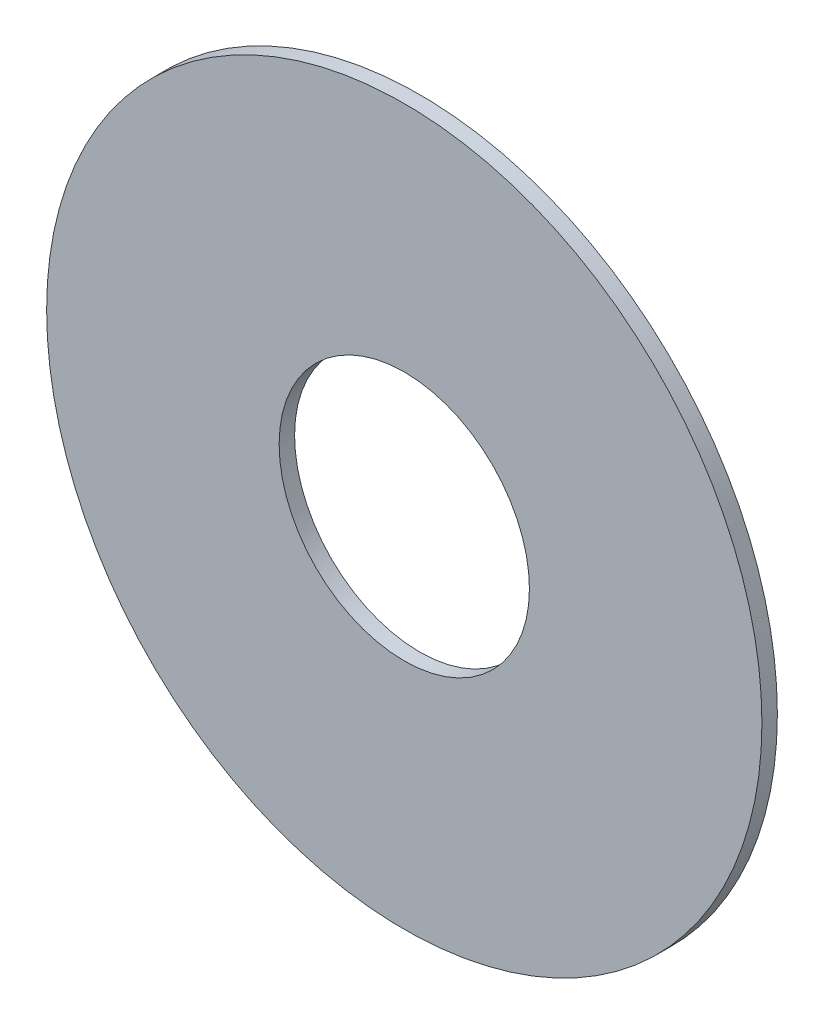
ISO-10303-21;
HEADER;
FILE_DESCRIPTION(('STEP AP214'),'2;1');
FILE_NAME('part.step','',(''),(''),'','','');
FILE_SCHEMA(('AUTOMOTIVE_DESIGN { 1 0 10303 214 1 1 1 1 }'));
ENDSEC;
DATA;
#1=APPLICATION_CONTEXT('core data for automotive mechanical design processes');
#2=APPLICATION_PROTOCOL_DEFINITION('international standard','automotive_design',2000,#1);
#3=PRODUCT_CONTEXT('',#1,'mechanical');
#4=PRODUCT('Part','Part','',(#3));
#5=PRODUCT_RELATED_PRODUCT_CATEGORY('part','',(#4));
#6=PRODUCT_DEFINITION_FORMATION('','',#4);
#7=PRODUCT_DEFINITION_CONTEXT('part definition',#1,'design');
#8=PRODUCT_DEFINITION('design','',#6,#7);
#9=PRODUCT_DEFINITION_SHAPE('','',#8);
#10=(LENGTH_UNIT() NAMED_UNIT(*) SI_UNIT(.MILLI.,.METRE.));
#11=(NAMED_UNIT(*) PLANE_ANGLE_UNIT() SI_UNIT($,.RADIAN.));
#12=(NAMED_UNIT(*) SI_UNIT($,.STERADIAN.) SOLID_ANGLE_UNIT());
#13=UNCERTAINTY_MEASURE_WITH_UNIT(LENGTH_MEASURE(1.E-05),#10,'distance_accuracy_value','');
#14=(GEOMETRIC_REPRESENTATION_CONTEXT(3) GLOBAL_UNCERTAINTY_ASSIGNED_CONTEXT((#13)) GLOBAL_UNIT_ASSIGNED_CONTEXT((#10,
#11,#12)) REPRESENTATION_CONTEXT('',''));
#15=CARTESIAN_POINT('',(0.,0.,0.));
#16=DIRECTION('',(0.,0.,1.));
#17=DIRECTION('',(1.,0.,0.));
#18=AXIS2_PLACEMENT_3D('',#15,#16,#17);
#19=CARTESIAN_POINT('',(0.,0.,40.));
#20=DIRECTION('',(0.,0.,1.));
#21=DIRECTION('',(1.,0.,0.));
#22=AXIS2_PLACEMENT_3D('',#19,#20,#21);
#23=CYLINDRICAL_SURFACE('',#22,115.75);
#24=CARTESIAN_POINT('',(0.,0.,40.));
#25=DIRECTION('',(0.,0.,1.));
#26=DIRECTION('',(1.,0.,0.));
#27=AXIS2_PLACEMENT_3D('',#24,#25,#26);
#28=CIRCLE('',#27,115.75);
#29=CARTESIAN_POINT('',(115.75,0.,40.));
#30=VERTEX_POINT('',#29);
#31=EDGE_CURVE('E10',#30,#30,#28,.T.);
#32=ORIENTED_EDGE('',*,*,#31,.T.);
#33=EDGE_LOOP('',(#32));
#34=FACE_BOUND('',#33,.T.);
#35=CARTESIAN_POINT('',(0.,0.,45.));
#36=DIRECTION('',(0.,0.,1.));
#37=DIRECTION('',(1.,0.,0.));
#38=AXIS2_PLACEMENT_3D('',#35,#36,#37);
#39=CIRCLE('',#38,115.75);
#40=CARTESIAN_POINT('',(115.75,0.,45.));
#41=VERTEX_POINT('',#40);
#42=EDGE_CURVE('E35',#41,#41,#39,.T.);
#43=ORIENTED_EDGE('',*,*,#42,.F.);
#44=EDGE_LOOP('',(#43));
#45=FACE_BOUND('',#44,.T.);
#46=ADVANCED_FACE('F32',(#34,#45),#23,.T.);
#47=CARTESIAN_POINT('',(0.,0.,40.));
#48=DIRECTION('',(0.,0.,1.));
#49=DIRECTION('',(1.,0.,0.));
#50=AXIS2_PLACEMENT_3D('',#47,#48,#49);
#51=PLANE('',#50);
#52=CARTESIAN_POINT('',(0.,0.,40.));
#53=DIRECTION('',(0.,0.,1.));
#54=DIRECTION('',(1.,0.,0.));
#55=AXIS2_PLACEMENT_3D('',#52,#53,#54);
#56=CIRCLE('',#55,40.5);
#57=CARTESIAN_POINT('',(40.5,0.,40.));
#58=VERTEX_POINT('',#57);
#59=EDGE_CURVE('E42',#58,#58,#56,.T.);
#60=ORIENTED_EDGE('',*,*,#59,.T.);
#61=EDGE_LOOP('',(#60));
#62=FACE_BOUND('',#61,.T.);
#63=ORIENTED_EDGE('',*,*,#31,.F.);
#64=EDGE_LOOP('',(#63));
#65=FACE_BOUND('',#64,.T.);
#66=ADVANCED_FACE('F50',(#62,#65),#51,.F.);
#67=CARTESIAN_POINT('',(0.,0.,45.));
#68=DIRECTION('',(0.,0.,1.));
#69=DIRECTION('',(1.,0.,0.));
#70=AXIS2_PLACEMENT_3D('',#67,#68,#69);
#71=PLANE('',#70);
#72=CARTESIAN_POINT('',(0.,0.,45.));
#73=DIRECTION('',(0.,0.,1.));
#74=DIRECTION('',(1.,0.,0.));
#75=AXIS2_PLACEMENT_3D('',#72,#73,#74);
#76=CIRCLE('',#75,40.5);
#77=CARTESIAN_POINT('',(40.5,0.,45.));
#78=VERTEX_POINT('',#77);
#79=EDGE_CURVE('E44',#78,#78,#76,.T.);
#80=ORIENTED_EDGE('',*,*,#79,.F.);
#81=EDGE_LOOP('',(#80));
#82=FACE_BOUND('',#81,.T.);
#83=ORIENTED_EDGE('',*,*,#42,.T.);
#84=EDGE_LOOP('',(#83));
#85=FACE_BOUND('',#84,.T.);
#86=ADVANCED_FACE('F56',(#82,#85),#71,.T.);
#87=CARTESIAN_POINT('',(0.,0.,40.));
#88=DIRECTION('',(0.,0.,1.));
#89=DIRECTION('',(1.,0.,0.));
#90=AXIS2_PLACEMENT_3D('',#87,#88,#89);
#91=CYLINDRICAL_SURFACE('',#90,40.5);
#92=ORIENTED_EDGE('',*,*,#59,.F.);
#93=EDGE_LOOP('',(#92));
#94=FACE_BOUND('',#93,.T.);
#95=ORIENTED_EDGE('',*,*,#79,.T.);
#96=EDGE_LOOP('',(#95));
#97=FACE_BOUND('',#96,.T.);
#98=ADVANCED_FACE('F53',(#94,#97),#91,.F.);
#99=CLOSED_SHELL('',(#46,#66,#86,#98));
#100=MANIFOLD_SOLID_BREP('B2',#99);
#101=ADVANCED_BREP_SHAPE_REPRESENTATION('',(#18,#100),#14);
#102=SHAPE_DEFINITION_REPRESENTATION(#9,#101);
ENDSEC;
END-ISO-10303-21;
